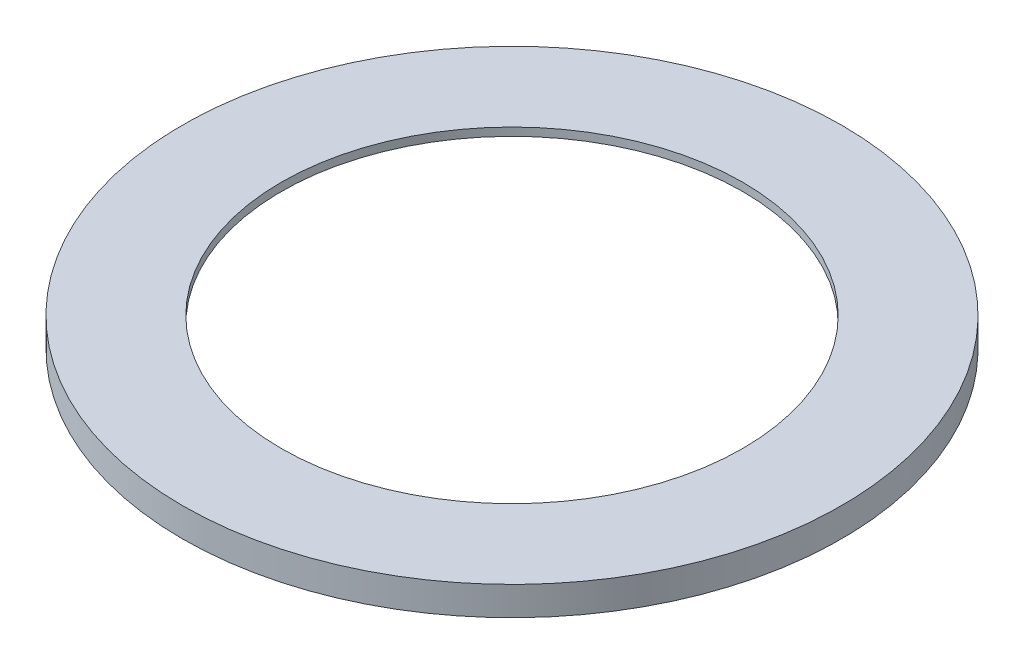
ISO-10303-21;
HEADER;
FILE_DESCRIPTION(('STEP AP214'),'2;1');
FILE_NAME('part.step','',(''),(''),'','','');
FILE_SCHEMA(('AUTOMOTIVE_DESIGN { 1 0 10303 214 1 1 1 1 }'));
ENDSEC;
DATA;
#1=APPLICATION_CONTEXT('core data for automotive mechanical design processes');
#2=APPLICATION_PROTOCOL_DEFINITION('international standard','automotive_design',2000,#1);
#3=PRODUCT_CONTEXT('',#1,'mechanical');
#4=PRODUCT('Part','Part','',(#3));
#5=PRODUCT_RELATED_PRODUCT_CATEGORY('part','',(#4));
#6=PRODUCT_DEFINITION_FORMATION('','',#4);
#7=PRODUCT_DEFINITION_CONTEXT('part definition',#1,'design');
#8=PRODUCT_DEFINITION('design','',#6,#7);
#9=PRODUCT_DEFINITION_SHAPE('','',#8);
#10=(LENGTH_UNIT() NAMED_UNIT(*) SI_UNIT(.MILLI.,.METRE.));
#11=(NAMED_UNIT(*) PLANE_ANGLE_UNIT() SI_UNIT($,.RADIAN.));
#12=(NAMED_UNIT(*) SI_UNIT($,.STERADIAN.) SOLID_ANGLE_UNIT());
#13=UNCERTAINTY_MEASURE_WITH_UNIT(LENGTH_MEASURE(1.E-05),#10,'distance_accuracy_value','');
#14=(GEOMETRIC_REPRESENTATION_CONTEXT(3) GLOBAL_UNCERTAINTY_ASSIGNED_CONTEXT((#13)) GLOBAL_UNIT_ASSIGNED_CONTEXT((#10,
#11,#12)) REPRESENTATION_CONTEXT('',''));
#15=CARTESIAN_POINT('',(0.,0.,0.));
#16=DIRECTION('',(0.,0.,1.));
#17=DIRECTION('',(1.,0.,0.));
#18=AXIS2_PLACEMENT_3D('',#15,#16,#17);
#19=CARTESIAN_POINT('',(0.,5.,0.));
#20=DIRECTION('',(0.,1.,0.));
#21=DIRECTION('',(0.,0.,1.));
#22=AXIS2_PLACEMENT_3D('',#19,#20,#21);
#23=PLANE('',#22);
#24=CARTESIAN_POINT('',(0.,5.,0.));
#25=DIRECTION('',(0.,1.,0.));
#26=DIRECTION('',(0.,0.,1.));
#27=AXIS2_PLACEMENT_3D('',#24,#25,#26);
#28=CIRCLE('',#27,57.15);
#29=CARTESIAN_POINT('',(0.,5.,57.15));
#30=VERTEX_POINT('',#29);
#31=EDGE_CURVE('E10',#30,#30,#28,.T.);
#32=ORIENTED_EDGE('',*,*,#31,.T.);
#33=EDGE_LOOP('',(#32));
#34=FACE_BOUND('',#33,.T.);
#35=CARTESIAN_POINT('',(0.,5.,0.));
#36=DIRECTION('',(0.,1.,0.));
#37=DIRECTION('',(0.,0.,1.));
#38=AXIS2_PLACEMENT_3D('',#35,#36,#37);
#39=CIRCLE('',#38,40.);
#40=CARTESIAN_POINT('',(0.,5.,40.));
#41=VERTEX_POINT('',#40);
#42=EDGE_CURVE('E40',#41,#41,#39,.T.);
#43=ORIENTED_EDGE('',*,*,#42,.F.);
#44=EDGE_LOOP('',(#43));
#45=FACE_BOUND('',#44,.T.);
#46=ADVANCED_FACE('F33',(#34,#45),#23,.T.);
#47=CARTESIAN_POINT('',(0.,5.,0.));
#48=DIRECTION('',(0.,-1.,0.));
#49=DIRECTION('',(0.,0.,-1.));
#50=AXIS2_PLACEMENT_3D('',#47,#48,#49);
#51=CYLINDRICAL_SURFACE('',#50,57.15);
#52=ORIENTED_EDGE('',*,*,#31,.F.);
#53=EDGE_LOOP('',(#52));
#54=FACE_BOUND('',#53,.T.);
#55=CARTESIAN_POINT('',(0.,0.,0.));
#56=DIRECTION('',(0.,-1.,0.));
#57=DIRECTION('',(0.,0.,-1.));
#58=AXIS2_PLACEMENT_3D('',#55,#56,#57);
#59=CIRCLE('',#58,57.15);
#60=CARTESIAN_POINT('',(0.,0.,-57.15));
#61=VERTEX_POINT('',#60);
#62=EDGE_CURVE('E48',#61,#61,#59,.T.);
#63=ORIENTED_EDGE('',*,*,#62,.F.);
#64=EDGE_LOOP('',(#63));
#65=FACE_BOUND('',#64,.T.);
#66=ADVANCED_FACE('F35',(#54,#65),#51,.T.);
#67=CARTESIAN_POINT('',(0.,5.,0.));
#68=DIRECTION('',(0.,-1.,0.));
#69=DIRECTION('',(0.,0.,-1.));
#70=AXIS2_PLACEMENT_3D('',#67,#68,#69);
#71=CYLINDRICAL_SURFACE('',#70,40.);
#72=CARTESIAN_POINT('',(0.,3.6,0.));
#73=DIRECTION('',(0.,-1.,0.));
#74=DIRECTION('',(0.,0.,-1.));
#75=AXIS2_PLACEMENT_3D('',#72,#73,#74);
#76=CIRCLE('',#75,40.);
#77=CARTESIAN_POINT('',(0.,3.6,-40.));
#78=VERTEX_POINT('',#77);
#79=EDGE_CURVE('E44',#78,#78,#76,.T.);
#80=ORIENTED_EDGE('',*,*,#79,.T.);
#81=EDGE_LOOP('',(#80));
#82=FACE_BOUND('',#81,.T.);
#83=ORIENTED_EDGE('',*,*,#42,.T.);
#84=EDGE_LOOP('',(#83));
#85=FACE_BOUND('',#84,.T.);
#86=ADVANCED_FACE('F57',(#82,#85),#71,.F.);
#87=CARTESIAN_POINT('',(0.,0.,0.));
#88=DIRECTION('',(0.,-1.,0.));
#89=DIRECTION('',(0.,0.,-1.));
#90=AXIS2_PLACEMENT_3D('',#87,#88,#89);
#91=CONICAL_SURFACE('',#90,57.15,1.36388790337796);
#92=ORIENTED_EDGE('',*,*,#79,.F.);
#93=EDGE_LOOP('',(#92));
#94=FACE_BOUND('',#93,.T.);
#95=ORIENTED_EDGE('',*,*,#62,.T.);
#96=EDGE_LOOP('',(#95));
#97=FACE_BOUND('',#96,.T.);
#98=ADVANCED_FACE('F54',(#94,#97),#91,.F.);
#99=CLOSED_SHELL('',(#46,#66,#86,#98));
#100=MANIFOLD_SOLID_BREP('B2',#99);
#101=ADVANCED_BREP_SHAPE_REPRESENTATION('',(#18,#100),#14);
#102=SHAPE_DEFINITION_REPRESENTATION(#9,#101);
ENDSEC;
END-ISO-10303-21;
